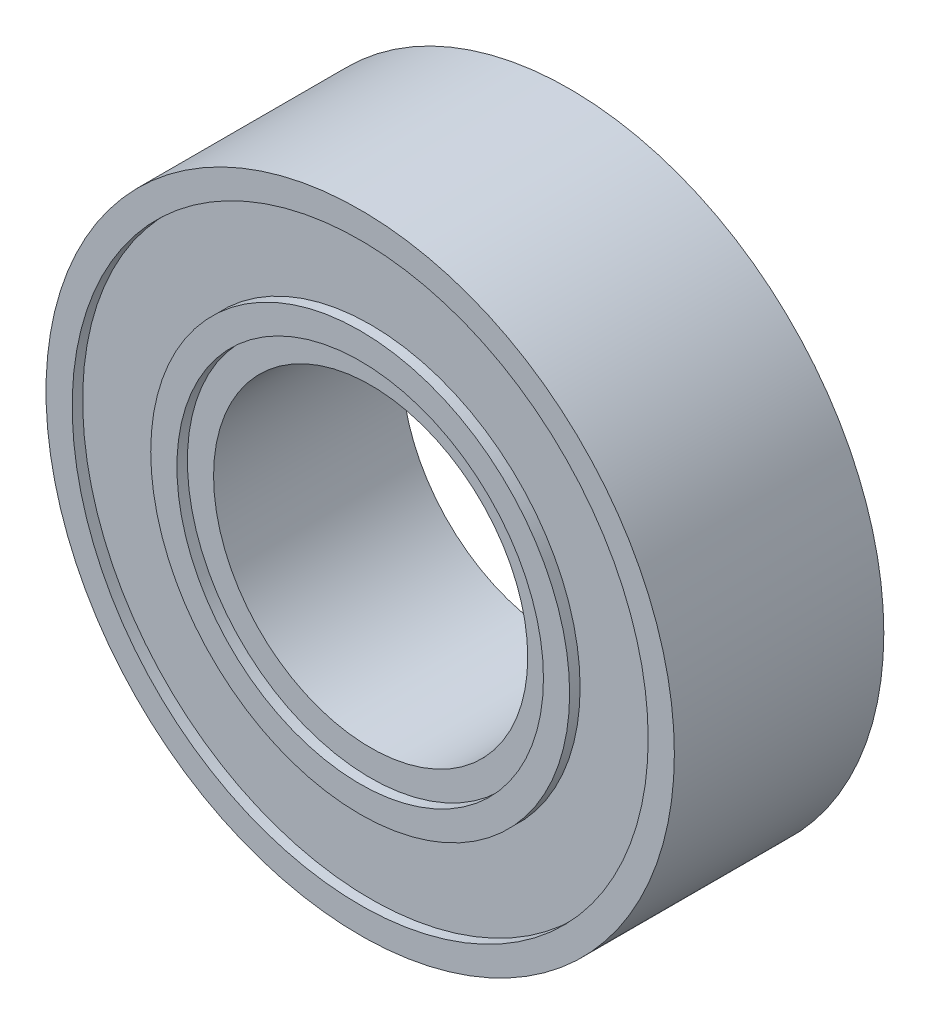
ISO-10303-21;
HEADER;
FILE_DESCRIPTION(('STEP AP214'),'2;1');
FILE_NAME('part.step','',(''),(''),'','','');
FILE_SCHEMA(('AUTOMOTIVE_DESIGN { 1 0 10303 214 1 1 1 1 }'));
ENDSEC;
DATA;
#1=APPLICATION_CONTEXT('core data for automotive mechanical design processes');
#2=APPLICATION_PROTOCOL_DEFINITION('international standard','automotive_design',2000,#1);
#3=PRODUCT_CONTEXT('',#1,'mechanical');
#4=PRODUCT('Part','Part','',(#3));
#5=PRODUCT_RELATED_PRODUCT_CATEGORY('part','',(#4));
#6=PRODUCT_DEFINITION_FORMATION('','',#4);
#7=PRODUCT_DEFINITION_CONTEXT('part definition',#1,'design');
#8=PRODUCT_DEFINITION('design','',#6,#7);
#9=PRODUCT_DEFINITION_SHAPE('','',#8);
#10=(LENGTH_UNIT() NAMED_UNIT(*) SI_UNIT(.MILLI.,.METRE.));
#11=(NAMED_UNIT(*) PLANE_ANGLE_UNIT() SI_UNIT($,.RADIAN.));
#12=(NAMED_UNIT(*) SI_UNIT($,.STERADIAN.) SOLID_ANGLE_UNIT());
#13=UNCERTAINTY_MEASURE_WITH_UNIT(LENGTH_MEASURE(1.E-05),#10,'distance_accuracy_value','');
#14=(GEOMETRIC_REPRESENTATION_CONTEXT(3) GLOBAL_UNCERTAINTY_ASSIGNED_CONTEXT((#13)) GLOBAL_UNIT_ASSIGNED_CONTEXT((#10,
#11,#12)) REPRESENTATION_CONTEXT('',''));
#15=CARTESIAN_POINT('',(0.,0.,0.));
#16=DIRECTION('',(0.,0.,1.));
#17=DIRECTION('',(1.,0.,0.));
#18=AXIS2_PLACEMENT_3D('',#15,#16,#17);
#19=CARTESIAN_POINT('',(-6.00000000000001,0.,-4.));
#20=DIRECTION('',(0.,0.,0.999999999999967));
#21=DIRECTION('',(0.999999999999967,0.,0.));
#22=AXIS2_PLACEMENT_3D('',#19,#20,#21);
#23=PLANE('',#22);
#24=CARTESIAN_POINT('',(0.,0.,-4.));
#25=DIRECTION('',(0.,0.,0.999999999999967));
#26=DIRECTION('',(0.999999999999967,0.,0.));
#27=AXIS2_PLACEMENT_3D('',#24,#25,#26);
#28=CIRCLE('',#27,3.5);
#29=CARTESIAN_POINT('',(3.49999999999988,0.,-4.));
#30=VERTEX_POINT('',#29);
#31=EDGE_CURVE('E85',#30,#30,#28,.T.);
#32=ORIENTED_EDGE('',*,*,#31,.T.);
#33=EDGE_LOOP('',(#32));
#34=FACE_BOUND('',#33,.T.);
#35=CARTESIAN_POINT('',(0.,0.,-4.));
#36=DIRECTION('',(0.,0.,0.999999999999967));
#37=DIRECTION('',(0.999999999999967,0.,0.));
#38=AXIS2_PLACEMENT_3D('',#35,#36,#37);
#39=CIRCLE('',#38,4.);
#40=CARTESIAN_POINT('',(3.99999999999987,0.,-4.));
#41=VERTEX_POINT('',#40);
#42=EDGE_CURVE('E98',#41,#41,#39,.T.);
#43=ORIENTED_EDGE('',*,*,#42,.F.);
#44=EDGE_LOOP('',(#43));
#45=FACE_BOUND('',#44,.T.);
#46=ADVANCED_FACE('F46',(#34,#45),#23,.F.);
#47=CARTESIAN_POINT('',(0.,0.,0.));
#48=DIRECTION('',(0.,0.,0.999999999999967));
#49=DIRECTION('',(0.999999999999967,0.,0.));
#50=AXIS2_PLACEMENT_3D('',#47,#48,#49);
#51=CYLINDRICAL_SURFACE('',#50,3.);
#52=CARTESIAN_POINT('',(0.,0.,-0.200000000000006));
#53=DIRECTION('',(0.,0.,0.999999999999967));
#54=DIRECTION('',(0.999999999999967,0.,0.));
#55=AXIS2_PLACEMENT_3D('',#52,#53,#54);
#56=CIRCLE('',#55,3.);
#57=CARTESIAN_POINT('',(2.9999999999999,0.,-0.200000000000006));
#58=VERTEX_POINT('',#57);
#59=EDGE_CURVE('E59',#58,#58,#56,.F.);
#60=ORIENTED_EDGE('',*,*,#59,.F.);
#61=EDGE_LOOP('',(#60));
#62=FACE_BOUND('',#61,.T.);
#63=CARTESIAN_POINT('',(0.,0.,-3.8));
#64=DIRECTION('',(0.,0.,-0.999999999999967));
#65=DIRECTION('',(-0.999999999999967,0.,0.));
#66=AXIS2_PLACEMENT_3D('',#63,#64,#65);
#67=CIRCLE('',#66,3.);
#68=CARTESIAN_POINT('',(-2.9999999999999,0.,-3.8));
#69=VERTEX_POINT('',#68);
#70=EDGE_CURVE('E50',#69,#69,#67,.F.);
#71=ORIENTED_EDGE('',*,*,#70,.F.);
#72=EDGE_LOOP('',(#71));
#73=FACE_BOUND('',#72,.T.);
#74=ADVANCED_FACE('F48',(#62,#73),#51,.F.);
#75=CARTESIAN_POINT('',(-3.,0.,0.));
#76=DIRECTION('',(0.,0.,-0.999999999999967));
#77=DIRECTION('',(-0.999999999999967,0.,0.));
#78=AXIS2_PLACEMENT_3D('',#75,#76,#77);
#79=PLANE('',#78);
#80=CARTESIAN_POINT('',(0.,0.,0.));
#81=DIRECTION('',(0.,0.,0.999999999999967));
#82=DIRECTION('',(0.999999999999967,0.,0.));
#83=AXIS2_PLACEMENT_3D('',#80,#81,#82);
#84=CIRCLE('',#83,3.5);
#85=CARTESIAN_POINT('',(3.49999999999988,0.,0.));
#86=VERTEX_POINT('',#85);
#87=EDGE_CURVE('E67',#86,#86,#84,.T.);
#88=ORIENTED_EDGE('',*,*,#87,.F.);
#89=EDGE_LOOP('',(#88));
#90=FACE_BOUND('',#89,.T.);
#91=CARTESIAN_POINT('',(0.,0.,0.));
#92=DIRECTION('',(0.,0.,0.999999999999967));
#93=DIRECTION('',(0.999999999999967,0.,0.));
#94=AXIS2_PLACEMENT_3D('',#91,#92,#93);
#95=CIRCLE('',#94,4.);
#96=CARTESIAN_POINT('',(3.99999999999987,0.,0.));
#97=VERTEX_POINT('',#96);
#98=EDGE_CURVE('E80',#97,#97,#95,.T.);
#99=ORIENTED_EDGE('',*,*,#98,.T.);
#100=EDGE_LOOP('',(#99));
#101=FACE_BOUND('',#100,.T.);
#102=ADVANCED_FACE('F120',(#90,#101),#79,.F.);
#103=CARTESIAN_POINT('',(0.,0.,0.));
#104=DIRECTION('',(0.,0.,0.999999999999967));
#105=DIRECTION('',(0.999999999999967,0.,0.));
#106=AXIS2_PLACEMENT_3D('',#103,#104,#105);
#107=CIRCLE('',#106,5.5);
#108=CARTESIAN_POINT('',(5.49999999999982,0.,0.));
#109=VERTEX_POINT('',#108);
#110=EDGE_CURVE('E74',#109,#109,#107,.T.);
#111=ORIENTED_EDGE('',*,*,#110,.F.);
#112=EDGE_LOOP('',(#111));
#113=FACE_BOUND('',#112,.T.);
#114=CARTESIAN_POINT('',(0.,0.,0.));
#115=DIRECTION('',(0.,0.,0.999999999999967));
#116=DIRECTION('',(0.999999999999967,0.,0.));
#117=AXIS2_PLACEMENT_3D('',#114,#115,#116);
#118=CIRCLE('',#117,6.);
#119=CARTESIAN_POINT('',(5.9999999999998,0.,0.));
#120=VERTEX_POINT('',#119);
#121=EDGE_CURVE('E12',#120,#120,#118,.T.);
#122=ORIENTED_EDGE('',*,*,#121,.T.);
#123=EDGE_LOOP('',(#122));
#124=FACE_BOUND('',#123,.T.);
#125=ADVANCED_FACE('F134',(#113,#124),#79,.F.);
#126=CARTESIAN_POINT('',(0.,0.,0.));
#127=DIRECTION('',(0.,0.,0.999999999999967));
#128=DIRECTION('',(0.999999999999967,0.,0.));
#129=AXIS2_PLACEMENT_3D('',#126,#127,#128);
#130=CYLINDRICAL_SURFACE('',#129,6.);
#131=ORIENTED_EDGE('',*,*,#121,.F.);
#132=EDGE_LOOP('',(#131));
#133=FACE_BOUND('',#132,.T.);
#134=CARTESIAN_POINT('',(0.,0.,-4.));
#135=DIRECTION('',(0.,0.,0.999999999999967));
#136=DIRECTION('',(0.999999999999967,0.,0.));
#137=AXIS2_PLACEMENT_3D('',#134,#135,#136);
#138=CIRCLE('',#137,6.);
#139=CARTESIAN_POINT('',(5.9999999999998,0.,-4.));
#140=VERTEX_POINT('',#139);
#141=EDGE_CURVE('E54',#140,#140,#138,.T.);
#142=ORIENTED_EDGE('',*,*,#141,.T.);
#143=EDGE_LOOP('',(#142));
#144=FACE_BOUND('',#143,.T.);
#145=ADVANCED_FACE('F126',(#133,#144),#130,.T.);
#146=CARTESIAN_POINT('',(0.,0.,-4.));
#147=DIRECTION('',(0.,0.,0.999999999999967));
#148=DIRECTION('',(0.999999999999967,0.,0.));
#149=AXIS2_PLACEMENT_3D('',#146,#147,#148);
#150=CIRCLE('',#149,5.5);
#151=CARTESIAN_POINT('',(5.49999999999982,0.,-4.));
#152=VERTEX_POINT('',#151);
#153=EDGE_CURVE('E92',#152,#152,#150,.T.);
#154=ORIENTED_EDGE('',*,*,#153,.T.);
#155=EDGE_LOOP('',(#154));
#156=FACE_BOUND('',#155,.T.);
#157=ORIENTED_EDGE('',*,*,#141,.F.);
#158=EDGE_LOOP('',(#157));
#159=FACE_BOUND('',#158,.T.);
#160=ADVANCED_FACE('F116',(#156,#159),#23,.F.);
#161=CARTESIAN_POINT('',(0.,0.,-0.200000000000006));
#162=DIRECTION('',(0.,0.,0.999999999999967));
#163=DIRECTION('',(0.999999999999967,0.,0.));
#164=AXIS2_PLACEMENT_3D('',#161,#162,#163);
#165=PLANE('',#164);
#166=CARTESIAN_POINT('',(0.,0.,-0.200000000000006));
#167=DIRECTION('',(0.,0.,0.999999999999967));
#168=DIRECTION('',(0.999999999999967,0.,0.));
#169=AXIS2_PLACEMENT_3D('',#166,#167,#168);
#170=CIRCLE('',#169,3.5);
#171=CARTESIAN_POINT('',(3.49999999999988,0.,-0.200000000000006));
#172=VERTEX_POINT('',#171);
#173=EDGE_CURVE('E63',#172,#172,#170,.T.);
#174=ORIENTED_EDGE('',*,*,#173,.T.);
#175=EDGE_LOOP('',(#174));
#176=FACE_BOUND('',#175,.T.);
#177=ORIENTED_EDGE('',*,*,#59,.T.);
#178=EDGE_LOOP('',(#177));
#179=FACE_BOUND('',#178,.T.);
#180=ADVANCED_FACE('F125',(#176,#179),#165,.T.);
#181=CARTESIAN_POINT('',(0.,0.,-0.200000000000006));
#182=DIRECTION('',(0.,0.,0.999999999999967));
#183=DIRECTION('',(0.999999999999967,0.,0.));
#184=AXIS2_PLACEMENT_3D('',#181,#182,#183);
#185=CYLINDRICAL_SURFACE('',#184,3.5);
#186=ORIENTED_EDGE('',*,*,#173,.F.);
#187=EDGE_LOOP('',(#186));
#188=FACE_BOUND('',#187,.T.);
#189=ORIENTED_EDGE('',*,*,#87,.T.);
#190=EDGE_LOOP('',(#189));
#191=FACE_BOUND('',#190,.T.);
#192=ADVANCED_FACE('F132',(#188,#191),#185,.F.);
#193=CARTESIAN_POINT('',(0.,0.,-0.200000000000006));
#194=DIRECTION('',(0.,0.,0.999999999999967));
#195=DIRECTION('',(0.999999999999967,0.,0.));
#196=AXIS2_PLACEMENT_3D('',#193,#194,#195);
#197=CYLINDRICAL_SURFACE('',#196,5.5);
#198=CARTESIAN_POINT('',(0.,0.,-0.200000000000006));
#199=DIRECTION('',(0.,0.,0.999999999999967));
#200=DIRECTION('',(0.999999999999967,0.,0.));
#201=AXIS2_PLACEMENT_3D('',#198,#199,#200);
#202=CIRCLE('',#201,5.5);
#203=CARTESIAN_POINT('',(5.49999999999982,0.,-0.200000000000006));
#204=VERTEX_POINT('',#203);
#205=EDGE_CURVE('E72',#204,#204,#202,.T.);
#206=ORIENTED_EDGE('',*,*,#205,.F.);
#207=EDGE_LOOP('',(#206));
#208=FACE_BOUND('',#207,.T.);
#209=ORIENTED_EDGE('',*,*,#110,.T.);
#210=EDGE_LOOP('',(#209));
#211=FACE_BOUND('',#210,.T.);
#212=ADVANCED_FACE('F165',(#208,#211),#197,.F.);
#213=CARTESIAN_POINT('',(0.,0.,-0.200000000000006));
#214=DIRECTION('',(0.,0.,0.999999999999967));
#215=DIRECTION('',(0.999999999999967,0.,0.));
#216=AXIS2_PLACEMENT_3D('',#213,#214,#215);
#217=PLANE('',#216);
#218=CARTESIAN_POINT('',(0.,0.,-0.200000000000006));
#219=DIRECTION('',(0.,0.,0.999999999999967));
#220=DIRECTION('',(0.999999999999967,0.,0.));
#221=AXIS2_PLACEMENT_3D('',#218,#219,#220);
#222=CIRCLE('',#221,4.);
#223=CARTESIAN_POINT('',(3.99999999999987,0.,-0.200000000000006));
#224=VERTEX_POINT('',#223);
#225=EDGE_CURVE('E77',#224,#224,#222,.T.);
#226=ORIENTED_EDGE('',*,*,#225,.F.);
#227=EDGE_LOOP('',(#226));
#228=FACE_BOUND('',#227,.T.);
#229=ORIENTED_EDGE('',*,*,#205,.T.);
#230=EDGE_LOOP('',(#229));
#231=FACE_BOUND('',#230,.T.);
#232=ADVANCED_FACE('F161',(#228,#231),#217,.T.);
#233=CARTESIAN_POINT('',(0.,0.,-0.200000000000006));
#234=DIRECTION('',(0.,0.,0.999999999999967));
#235=DIRECTION('',(0.999999999999967,0.,0.));
#236=AXIS2_PLACEMENT_3D('',#233,#234,#235);
#237=CYLINDRICAL_SURFACE('',#236,4.);
#238=ORIENTED_EDGE('',*,*,#225,.T.);
#239=EDGE_LOOP('',(#238));
#240=FACE_BOUND('',#239,.T.);
#241=ORIENTED_EDGE('',*,*,#98,.F.);
#242=EDGE_LOOP('',(#241));
#243=FACE_BOUND('',#242,.T.);
#244=ADVANCED_FACE('F154',(#240,#243),#237,.T.);
#245=CARTESIAN_POINT('',(0.,0.,-3.8));
#246=DIRECTION('',(0.,0.,-0.999999999999967));
#247=DIRECTION('',(0.999999999999967,0.,0.));
#248=AXIS2_PLACEMENT_3D('',#245,#246,#247);
#249=PLANE('',#248);
#250=CARTESIAN_POINT('',(0.,0.,-3.8));
#251=DIRECTION('',(0.,0.,0.999999999999967));
#252=DIRECTION('',(0.999999999999967,0.,0.));
#253=AXIS2_PLACEMENT_3D('',#250,#251,#252);
#254=CIRCLE('',#253,3.5);
#255=CARTESIAN_POINT('',(3.49999999999988,0.,-3.8));
#256=VERTEX_POINT('',#255);
#257=EDGE_CURVE('E88',#256,#256,#254,.T.);
#258=ORIENTED_EDGE('',*,*,#257,.F.);
#259=EDGE_LOOP('',(#258));
#260=FACE_BOUND('',#259,.T.);
#261=ORIENTED_EDGE('',*,*,#70,.T.);
#262=EDGE_LOOP('',(#261));
#263=FACE_BOUND('',#262,.T.);
#264=ADVANCED_FACE('F151',(#260,#263),#249,.T.);
#265=CARTESIAN_POINT('',(0.,0.,-3.8));
#266=DIRECTION('',(0.,0.,-0.999999999999967));
#267=DIRECTION('',(-0.999999999999967,0.,0.));
#268=AXIS2_PLACEMENT_3D('',#265,#266,#267);
#269=CYLINDRICAL_SURFACE('',#268,3.5);
#270=ORIENTED_EDGE('',*,*,#257,.T.);
#271=EDGE_LOOP('',(#270));
#272=FACE_BOUND('',#271,.T.);
#273=ORIENTED_EDGE('',*,*,#31,.F.);
#274=EDGE_LOOP('',(#273));
#275=FACE_BOUND('',#274,.T.);
#276=ADVANCED_FACE('F147',(#272,#275),#269,.F.);
#277=CARTESIAN_POINT('',(0.,0.,-3.8));
#278=DIRECTION('',(0.,0.,-0.999999999999967));
#279=DIRECTION('',(0.999999999999967,0.,0.));
#280=AXIS2_PLACEMENT_3D('',#277,#278,#279);
#281=PLANE('',#280);
#282=CARTESIAN_POINT('',(0.,0.,-3.8));
#283=DIRECTION('',(0.,0.,0.999999999999967));
#284=DIRECTION('',(0.999999999999967,0.,0.));
#285=AXIS2_PLACEMENT_3D('',#282,#283,#284);
#286=CIRCLE('',#285,5.5);
#287=CARTESIAN_POINT('',(5.49999999999982,0.,-3.8));
#288=VERTEX_POINT('',#287);
#289=EDGE_CURVE('E89',#288,#288,#286,.T.);
#290=ORIENTED_EDGE('',*,*,#289,.F.);
#291=EDGE_LOOP('',(#290));
#292=FACE_BOUND('',#291,.T.);
#293=CARTESIAN_POINT('',(0.,0.,-3.8));
#294=DIRECTION('',(0.,0.,0.999999999999967));
#295=DIRECTION('',(0.999999999999967,0.,0.));
#296=AXIS2_PLACEMENT_3D('',#293,#294,#295);
#297=CIRCLE('',#296,4.);
#298=CARTESIAN_POINT('',(3.99999999999987,0.,-3.8));
#299=VERTEX_POINT('',#298);
#300=EDGE_CURVE('E95',#299,#299,#297,.T.);
#301=ORIENTED_EDGE('',*,*,#300,.T.);
#302=EDGE_LOOP('',(#301));
#303=FACE_BOUND('',#302,.T.);
#304=ADVANCED_FACE('F104',(#292,#303),#281,.T.);
#305=CARTESIAN_POINT('',(0.,0.,-3.8));
#306=DIRECTION('',(0.,0.,-0.999999999999967));
#307=DIRECTION('',(-0.999999999999967,0.,0.));
#308=AXIS2_PLACEMENT_3D('',#305,#306,#307);
#309=CYLINDRICAL_SURFACE('',#308,5.5);
#310=ORIENTED_EDGE('',*,*,#289,.T.);
#311=EDGE_LOOP('',(#310));
#312=FACE_BOUND('',#311,.T.);
#313=ORIENTED_EDGE('',*,*,#153,.F.);
#314=EDGE_LOOP('',(#313));
#315=FACE_BOUND('',#314,.T.);
#316=ADVANCED_FACE('F109',(#312,#315),#309,.F.);
#317=CARTESIAN_POINT('',(0.,0.,-3.8));
#318=DIRECTION('',(0.,0.,-0.999999999999967));
#319=DIRECTION('',(-0.999999999999967,0.,0.));
#320=AXIS2_PLACEMENT_3D('',#317,#318,#319);
#321=CYLINDRICAL_SURFACE('',#320,4.);
#322=ORIENTED_EDGE('',*,*,#300,.F.);
#323=EDGE_LOOP('',(#322));
#324=FACE_BOUND('',#323,.T.);
#325=ORIENTED_EDGE('',*,*,#42,.T.);
#326=EDGE_LOOP('',(#325));
#327=FACE_BOUND('',#326,.T.);
#328=ADVANCED_FACE('F106',(#324,#327),#321,.T.);
#329=CLOSED_SHELL('',(#46,#74,#102,#125,#145,#160,#180,#192,#212,#232,#244,#264,#276,#304,#316,#328));
#330=MANIFOLD_SOLID_BREP('B2',#329);
#331=ADVANCED_BREP_SHAPE_REPRESENTATION('',(#18,#330),#14);
#332=SHAPE_DEFINITION_REPRESENTATION(#9,#331);
ENDSEC;
END-ISO-10303-21;
